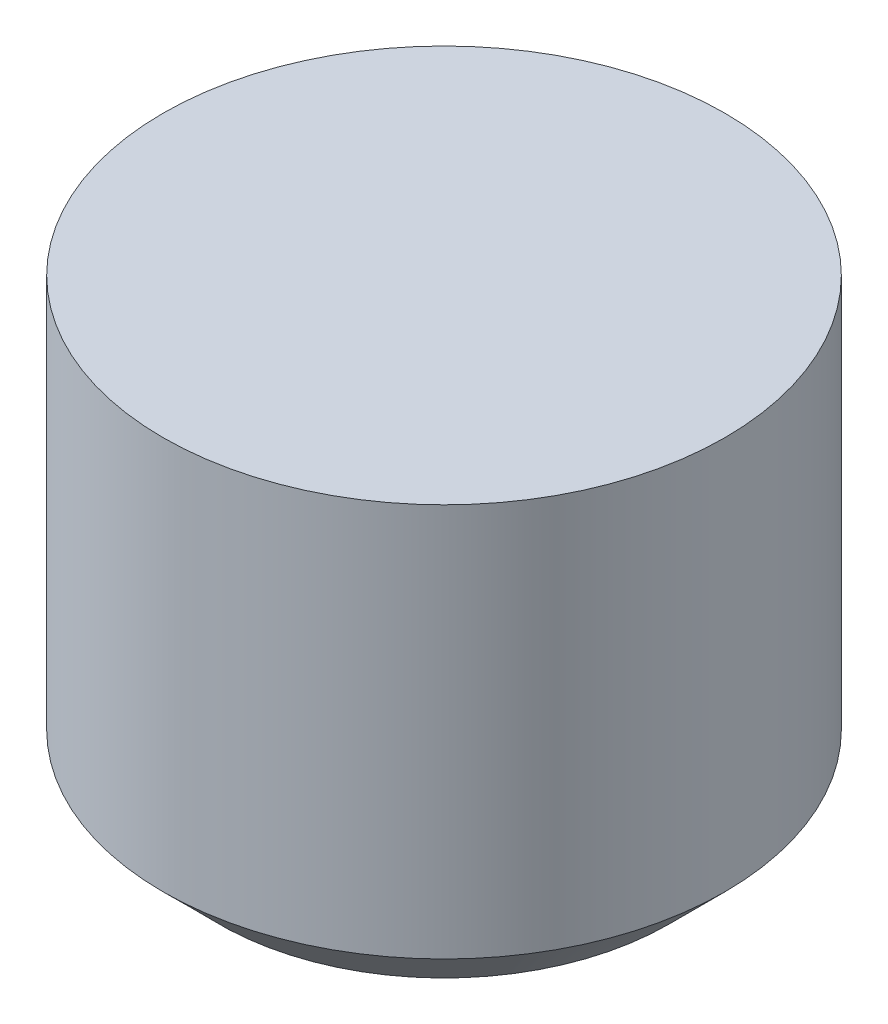
ISO-10303-21;
HEADER;
FILE_DESCRIPTION(('STEP AP214'),'2;1');
FILE_NAME('part.step','',(''),(''),'','','');
FILE_SCHEMA(('AUTOMOTIVE_DESIGN { 1 0 10303 214 1 1 1 1 }'));
ENDSEC;
DATA;
#1=APPLICATION_CONTEXT('core data for automotive mechanical design processes');
#2=APPLICATION_PROTOCOL_DEFINITION('international standard','automotive_design',2000,#1);
#3=PRODUCT_CONTEXT('',#1,'mechanical');
#4=PRODUCT('Part','Part','',(#3));
#5=PRODUCT_RELATED_PRODUCT_CATEGORY('part','',(#4));
#6=PRODUCT_DEFINITION_FORMATION('','',#4);
#7=PRODUCT_DEFINITION_CONTEXT('part definition',#1,'design');
#8=PRODUCT_DEFINITION('design','',#6,#7);
#9=PRODUCT_DEFINITION_SHAPE('','',#8);
#10=(LENGTH_UNIT() NAMED_UNIT(*) SI_UNIT(.MILLI.,.METRE.));
#11=(NAMED_UNIT(*) PLANE_ANGLE_UNIT() SI_UNIT($,.RADIAN.));
#12=(NAMED_UNIT(*) SI_UNIT($,.STERADIAN.) SOLID_ANGLE_UNIT());
#13=UNCERTAINTY_MEASURE_WITH_UNIT(LENGTH_MEASURE(1.E-05),#10,'distance_accuracy_value','');
#14=(GEOMETRIC_REPRESENTATION_CONTEXT(3) GLOBAL_UNCERTAINTY_ASSIGNED_CONTEXT((#13)) GLOBAL_UNIT_ASSIGNED_CONTEXT((#10,
#11,#12)) REPRESENTATION_CONTEXT('',''));
#15=CARTESIAN_POINT('',(0.,0.,0.));
#16=DIRECTION('',(0.,0.,1.));
#17=DIRECTION('',(1.,0.,0.));
#18=AXIS2_PLACEMENT_3D('',#15,#16,#17);
#19=CARTESIAN_POINT('',(0.,-2.,0.));
#20=DIRECTION('',(0.,1.,0.));
#21=DIRECTION('',(0.,0.,1.));
#22=AXIS2_PLACEMENT_3D('',#19,#20,#21);
#23=PLANE('',#22);
#24=CARTESIAN_POINT('',(0.,-1.99999999995271,0.));
#25=DIRECTION('',(0.,1.,0.));
#26=DIRECTION('',(-1.,0.,0.));
#27=AXIS2_PLACEMENT_3D('',#24,#25,#26);
#28=CIRCLE('',#27,2.00000000000955);
#29=CARTESIAN_POINT('',(-2.00000000000955,-1.99999999995271,0.));
#30=VERTEX_POINT('',#29);
#31=EDGE_CURVE('E19',#30,#30,#28,.T.);
#32=ORIENTED_EDGE('',*,*,#31,.F.);
#33=EDGE_LOOP('',(#32));
#34=FACE_BOUND('',#33,.T.);
#35=ADVANCED_FACE('F16',(#34),#23,.F.);
#36=CARTESIAN_POINT('',(0.,-1.50000000002137,0.));
#37=DIRECTION('',(0.,1.,0.));
#38=DIRECTION('',(-1.,0.,0.));
#39=AXIS2_PLACEMENT_3D('',#36,#37,#38);
#40=CONICAL_SURFACE('',#39,2.49999999994088,0.785398163397448);
#41=ORIENTED_EDGE('',*,*,#31,.T.);
#42=EDGE_LOOP('',(#41));
#43=FACE_BOUND('',#42,.T.);
#44=CARTESIAN_POINT('',(0.,-1.5,0.));
#45=DIRECTION('',(0.,-1.,0.));
#46=DIRECTION('',(0.,0.,-1.));
#47=AXIS2_PLACEMENT_3D('',#44,#45,#46);
#48=CIRCLE('',#47,2.5);
#49=CARTESIAN_POINT('',(0.,-1.5,-2.5));
#50=VERTEX_POINT('',#49);
#51=EDGE_CURVE('E23',#50,#50,#48,.F.);
#52=ORIENTED_EDGE('',*,*,#51,.F.);
#53=EDGE_LOOP('',(#52));
#54=FACE_BOUND('',#53,.T.);
#55=ADVANCED_FACE('F33',(#43,#54),#40,.T.);
#56=CARTESIAN_POINT('',(0.,2.,0.));
#57=DIRECTION('',(0.,1.,0.));
#58=DIRECTION('',(0.,0.,1.));
#59=AXIS2_PLACEMENT_3D('',#56,#57,#58);
#60=PLANE('',#59);
#61=CARTESIAN_POINT('',(0.,2.,0.));
#62=DIRECTION('',(0.,-1.,0.));
#63=DIRECTION('',(0.,0.,-1.));
#64=AXIS2_PLACEMENT_3D('',#61,#62,#63);
#65=CIRCLE('',#64,2.5);
#66=CARTESIAN_POINT('',(0.,2.,-2.5));
#67=VERTEX_POINT('',#66);
#68=EDGE_CURVE('E10',#67,#67,#65,.T.);
#69=ORIENTED_EDGE('',*,*,#68,.F.);
#70=EDGE_LOOP('',(#69));
#71=FACE_BOUND('',#70,.T.);
#72=ADVANCED_FACE('F40',(#71),#60,.T.);
#73=CARTESIAN_POINT('',(0.,2.,0.));
#74=DIRECTION('',(0.,-1.,0.));
#75=DIRECTION('',(0.,0.,-1.));
#76=AXIS2_PLACEMENT_3D('',#73,#74,#75);
#77=CYLINDRICAL_SURFACE('',#76,2.5);
#78=ORIENTED_EDGE('',*,*,#68,.T.);
#79=EDGE_LOOP('',(#78));
#80=FACE_BOUND('',#79,.T.);
#81=ORIENTED_EDGE('',*,*,#51,.T.);
#82=EDGE_LOOP('',(#81));
#83=FACE_BOUND('',#82,.T.);
#84=ADVANCED_FACE('F41',(#80,#83),#77,.T.);
#85=CLOSED_SHELL('',(#35,#55,#72,#84));
#86=MANIFOLD_SOLID_BREP('B1',#85);
#87=ADVANCED_BREP_SHAPE_REPRESENTATION('',(#18,#86),#14);
#88=SHAPE_DEFINITION_REPRESENTATION(#9,#87);
ENDSEC;
END-ISO-10303-21;
